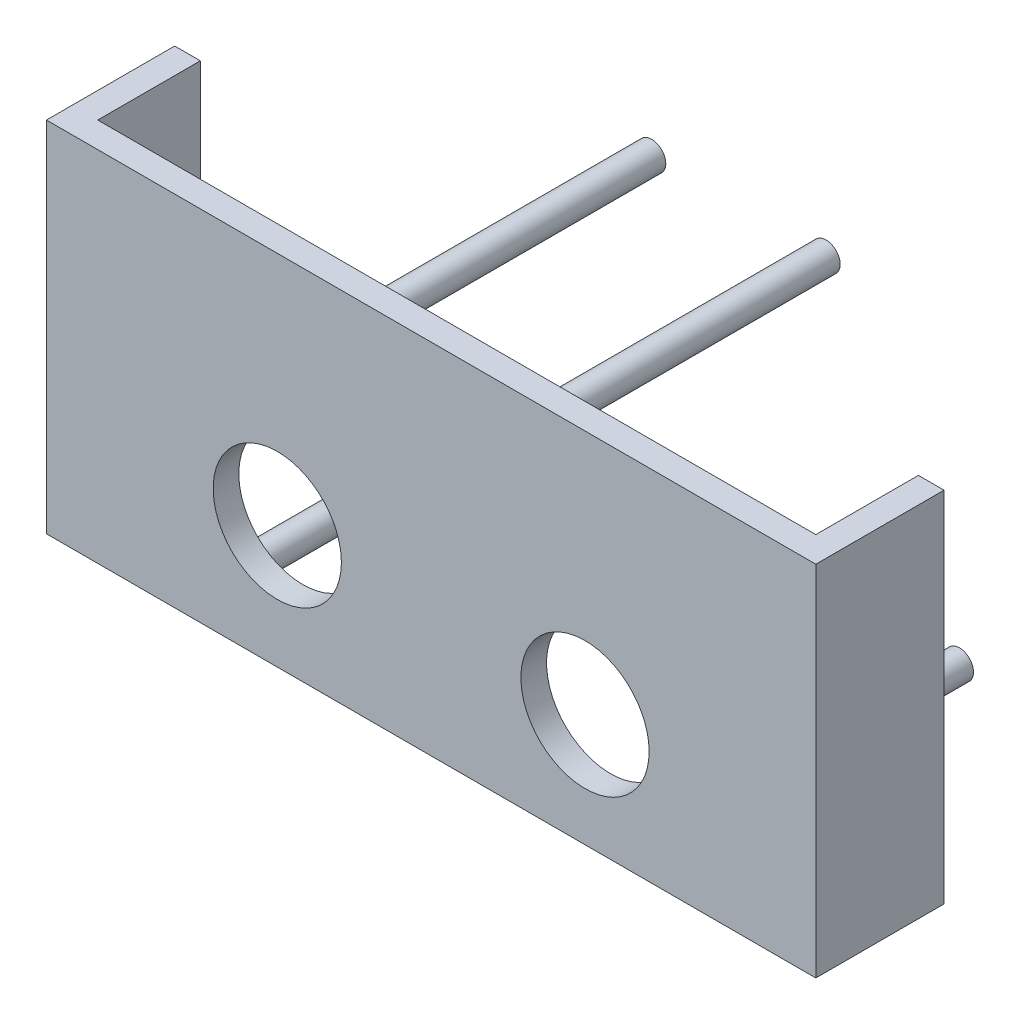
ISO-10303-21;
HEADER;
FILE_DESCRIPTION(('STEP AP214'),'2;1');
FILE_NAME('part.step','',(''),(''),'','','');
FILE_SCHEMA(('AUTOMOTIVE_DESIGN { 1 0 10303 214 1 1 1 1 }'));
ENDSEC;
DATA;
#1=APPLICATION_CONTEXT('core data for automotive mechanical design processes');
#2=APPLICATION_PROTOCOL_DEFINITION('international standard','automotive_design',2000,#1);
#3=PRODUCT_CONTEXT('',#1,'mechanical');
#4=PRODUCT('Part','Part','',(#3));
#5=PRODUCT_RELATED_PRODUCT_CATEGORY('part','',(#4));
#6=PRODUCT_DEFINITION_FORMATION('','',#4);
#7=PRODUCT_DEFINITION_CONTEXT('part definition',#1,'design');
#8=PRODUCT_DEFINITION('design','',#6,#7);
#9=PRODUCT_DEFINITION_SHAPE('','',#8);
#10=(LENGTH_UNIT() NAMED_UNIT(*) SI_UNIT(.MILLI.,.METRE.));
#11=(NAMED_UNIT(*) PLANE_ANGLE_UNIT() SI_UNIT($,.RADIAN.));
#12=(NAMED_UNIT(*) SI_UNIT($,.STERADIAN.) SOLID_ANGLE_UNIT());
#13=UNCERTAINTY_MEASURE_WITH_UNIT(LENGTH_MEASURE(1.E-05),#10,'distance_accuracy_value','');
#14=(GEOMETRIC_REPRESENTATION_CONTEXT(3) GLOBAL_UNCERTAINTY_ASSIGNED_CONTEXT((#13)) GLOBAL_UNIT_ASSIGNED_CONTEXT((#10,
#11,#12)) REPRESENTATION_CONTEXT('',''));
#15=CARTESIAN_POINT('',(0.,0.,0.));
#16=DIRECTION('',(0.,0.,1.));
#17=DIRECTION('',(1.,0.,0.));
#18=AXIS2_PLACEMENT_3D('',#15,#16,#17);
#19=CARTESIAN_POINT('',(0.,0.,0.));
#20=DIRECTION('',(0.,0.,1.));
#21=DIRECTION('',(1.,0.,0.));
#22=AXIS2_PLACEMENT_3D('',#19,#20,#21);
#23=PLANE('',#22);
#24=CARTESIAN_POINT('',(-7.,6.99999999999999,0.));
#25=DIRECTION('',(0.,0.,1.));
#26=DIRECTION('',(1.,0.,0.));
#27=AXIS2_PLACEMENT_3D('',#24,#25,#26);
#28=CIRCLE('',#27,2.75);
#29=CARTESIAN_POINT('',(-4.25,6.99999999999999,0.));
#30=VERTEX_POINT('',#29);
#31=EDGE_CURVE('E275',#30,#30,#28,.T.);
#32=ORIENTED_EDGE('',*,*,#31,.T.);
#33=EDGE_LOOP('',(#32));
#34=FACE_BOUND('',#33,.T.);
#35=CARTESIAN_POINT('',(-93.,6.99999999999999,0.));
#36=DIRECTION('',(0.,0.,1.));
#37=DIRECTION('',(1.,0.,0.));
#38=AXIS2_PLACEMENT_3D('',#35,#36,#37);
#39=CIRCLE('',#38,2.75000000000001);
#40=CARTESIAN_POINT('',(-90.25,6.99999999999999,0.));
#41=VERTEX_POINT('',#40);
#42=EDGE_CURVE('E282',#41,#41,#39,.T.);
#43=ORIENTED_EDGE('',*,*,#42,.T.);
#44=EDGE_LOOP('',(#43));
#45=FACE_BOUND('',#44,.T.);
#46=CARTESIAN_POINT('',(-33.,62.87,0.));
#47=DIRECTION('',(0.,0.,1.));
#48=DIRECTION('',(1.,0.,0.));
#49=AXIS2_PLACEMENT_3D('',#46,#47,#48);
#50=CIRCLE('',#49,2.75);
#51=CARTESIAN_POINT('',(-30.25,62.87,0.));
#52=VERTEX_POINT('',#51);
#53=EDGE_CURVE('E288',#52,#52,#50,.T.);
#54=ORIENTED_EDGE('',*,*,#53,.T.);
#55=EDGE_LOOP('',(#54));
#56=FACE_BOUND('',#55,.T.);
#57=CARTESIAN_POINT('',(-67.,62.87,0.));
#58=DIRECTION('',(0.,0.,1.));
#59=DIRECTION('',(1.,0.,0.));
#60=AXIS2_PLACEMENT_3D('',#57,#58,#59);
#61=CIRCLE('',#60,2.75000000000001);
#62=CARTESIAN_POINT('',(-64.25,62.87,0.));
#63=VERTEX_POINT('',#62);
#64=EDGE_CURVE('E125',#63,#63,#61,.T.);
#65=ORIENTED_EDGE('',*,*,#64,.T.);
#66=EDGE_LOOP('',(#65));
#67=FACE_BOUND('',#66,.T.);
#68=CARTESIAN_POINT('',(-20.,21.980812211656,0.));
#69=DIRECTION('',(0.,0.,1.));
#70=DIRECTION('',(1.,0.,0.));
#71=AXIS2_PLACEMENT_3D('',#68,#69,#70);
#72=CIRCLE('',#71,12.5);
#73=CARTESIAN_POINT('',(-7.5,21.980812211656,0.));
#74=VERTEX_POINT('',#73);
#75=EDGE_CURVE('E179',#74,#74,#72,.T.);
#76=ORIENTED_EDGE('',*,*,#75,.T.);
#77=EDGE_LOOP('',(#76));
#78=FACE_BOUND('',#77,.T.);
#79=CARTESIAN_POINT('',(-80.,23.9130923961962,0.));
#80=DIRECTION('',(0.,0.,1.));
#81=DIRECTION('',(1.,0.,0.));
#82=AXIS2_PLACEMENT_3D('',#79,#80,#81);
#83=CIRCLE('',#82,12.5);
#84=CARTESIAN_POINT('',(-67.5,23.9130923961962,0.));
#85=VERTEX_POINT('',#84);
#86=EDGE_CURVE('E185',#85,#85,#83,.T.);
#87=ORIENTED_EDGE('',*,*,#86,.T.);
#88=EDGE_LOOP('',(#87));
#89=FACE_BOUND('',#88,.T.);
#90=DIRECTION('',(0.,1.,0.));
#91=VECTOR('',#90,1.);
#92=CARTESIAN_POINT('',(20.,69.87,0.));
#93=LINE('',#92,#91);
#94=CARTESIAN_POINT('',(20.,0.,0.));
#95=VERTEX_POINT('',#94);
#96=CARTESIAN_POINT('',(20.,69.87,0.));
#97=VERTEX_POINT('',#96);
#98=EDGE_CURVE('E123',#95,#97,#93,.T.);
#99=ORIENTED_EDGE('',*,*,#98,.F.);
#100=DIRECTION('',(1.,0.,0.));
#101=VECTOR('',#100,1.);
#102=CARTESIAN_POINT('',(0.,0.,0.));
#103=LINE('',#102,#101);
#104=CARTESIAN_POINT('',(-120.,0.,0.));
#105=VERTEX_POINT('',#104);
#106=EDGE_CURVE('E154',#105,#95,#103,.T.);
#107=ORIENTED_EDGE('',*,*,#106,.F.);
#108=DIRECTION('',(0.,-1.,0.));
#109=VECTOR('',#108,1.);
#110=CARTESIAN_POINT('',(-120.,69.87,0.));
#111=LINE('',#110,#109);
#112=CARTESIAN_POINT('',(-120.,69.87,0.));
#113=VERTEX_POINT('',#112);
#114=EDGE_CURVE('E135',#113,#105,#111,.T.);
#115=ORIENTED_EDGE('',*,*,#114,.F.);
#116=DIRECTION('',(-1.,0.,0.));
#117=VECTOR('',#116,1.);
#118=CARTESIAN_POINT('',(0.,69.87,0.));
#119=LINE('',#118,#117);
#120=EDGE_CURVE('E37',#97,#113,#119,.T.);
#121=ORIENTED_EDGE('',*,*,#120,.F.);
#122=EDGE_LOOP('',(#99,#107,#115,#121));
#123=FACE_BOUND('',#122,.T.);
#124=ADVANCED_FACE('F33',(#34,#45,#56,#67,#78,#89,#123),#23,.F.);
#125=CARTESIAN_POINT('',(0.,69.87,5.));
#126=DIRECTION('',(0.,-1.,0.));
#127=DIRECTION('',(1.,0.,0.));
#128=AXIS2_PLACEMENT_3D('',#125,#126,#127);
#129=PLANE('',#128);
#130=DIRECTION('',(0.,0.,1.));
#131=VECTOR('',#130,1.);
#132=CARTESIAN_POINT('',(25.,69.87,0.));
#133=LINE('',#132,#131);
#134=CARTESIAN_POINT('',(25.,69.87,-20.));
#135=VERTEX_POINT('',#134);
#136=CARTESIAN_POINT('',(25.,69.87,5.));
#137=VERTEX_POINT('',#136);
#138=EDGE_CURVE('E108',#135,#137,#133,.T.);
#139=ORIENTED_EDGE('',*,*,#138,.F.);
#140=DIRECTION('',(1.,0.,0.));
#141=VECTOR('',#140,1.);
#142=CARTESIAN_POINT('',(25.,69.87,-20.));
#143=LINE('',#142,#141);
#144=CARTESIAN_POINT('',(20.,69.87,-20.));
#145=VERTEX_POINT('',#144);
#146=EDGE_CURVE('E122',#145,#135,#143,.T.);
#147=ORIENTED_EDGE('',*,*,#146,.F.);
#148=DIRECTION('',(0.,0.,1.));
#149=VECTOR('',#148,1.);
#150=CARTESIAN_POINT('',(20.,69.87,-20.));
#151=LINE('',#150,#149);
#152=EDGE_CURVE('E131',#145,#97,#151,.T.);
#153=ORIENTED_EDGE('',*,*,#152,.T.);
#154=ORIENTED_EDGE('',*,*,#120,.T.);
#155=DIRECTION('',(0.,0.,1.));
#156=VECTOR('',#155,1.);
#157=CARTESIAN_POINT('',(-120.,69.87,-20.));
#158=LINE('',#157,#156);
#159=CARTESIAN_POINT('',(-120.,69.87,-20.));
#160=VERTEX_POINT('',#159);
#161=EDGE_CURVE('E158',#160,#113,#158,.T.);
#162=ORIENTED_EDGE('',*,*,#161,.F.);
#163=DIRECTION('',(1.,0.,0.));
#164=VECTOR('',#163,1.);
#165=CARTESIAN_POINT('',(-125.,69.87,-20.));
#166=LINE('',#165,#164);
#167=CARTESIAN_POINT('',(-125.,69.87,-20.));
#168=VERTEX_POINT('',#167);
#169=EDGE_CURVE('E139',#168,#160,#166,.T.);
#170=ORIENTED_EDGE('',*,*,#169,.F.);
#171=DIRECTION('',(0.,0.,1.));
#172=VECTOR('',#171,1.);
#173=CARTESIAN_POINT('',(-125.,69.87,0.));
#174=LINE('',#173,#172);
#175=CARTESIAN_POINT('',(-125.,69.87,5.));
#176=VERTEX_POINT('',#175);
#177=EDGE_CURVE('E172',#168,#176,#174,.T.);
#178=ORIENTED_EDGE('',*,*,#177,.T.);
#179=DIRECTION('',(-1.,0.,0.));
#180=VECTOR('',#179,1.);
#181=CARTESIAN_POINT('',(0.,69.87,5.));
#182=LINE('',#181,#180);
#183=EDGE_CURVE('E43',#137,#176,#182,.T.);
#184=ORIENTED_EDGE('',*,*,#183,.F.);
#185=EDGE_LOOP('',(#139,#147,#153,#154,#162,#170,#178,#184));
#186=FACE_BOUND('',#185,.T.);
#187=ADVANCED_FACE('F35',(#186),#129,.F.);
#188=CARTESIAN_POINT('',(0.,0.,5.));
#189=DIRECTION('',(0.,1.,0.));
#190=DIRECTION('',(-1.,0.,0.));
#191=AXIS2_PLACEMENT_3D('',#188,#189,#190);
#192=PLANE('',#191);
#193=DIRECTION('',(0.,0.,1.));
#194=VECTOR('',#193,1.);
#195=CARTESIAN_POINT('',(-125.,0.,0.));
#196=LINE('',#195,#194);
#197=CARTESIAN_POINT('',(-125.,0.,-20.));
#198=VERTEX_POINT('',#197);
#199=CARTESIAN_POINT('',(-125.,0.,5.));
#200=VERTEX_POINT('',#199);
#201=EDGE_CURVE('E174',#198,#200,#196,.T.);
#202=ORIENTED_EDGE('',*,*,#201,.F.);
#203=DIRECTION('',(-1.,0.,0.));
#204=VECTOR('',#203,1.);
#205=CARTESIAN_POINT('',(-125.,0.,-20.));
#206=LINE('',#205,#204);
#207=CARTESIAN_POINT('',(-120.,0.,-20.));
#208=VERTEX_POINT('',#207);
#209=EDGE_CURVE('E143',#208,#198,#206,.T.);
#210=ORIENTED_EDGE('',*,*,#209,.F.);
#211=DIRECTION('',(0.,0.,1.));
#212=VECTOR('',#211,1.);
#213=CARTESIAN_POINT('',(-120.,0.,-20.));
#214=LINE('',#213,#212);
#215=EDGE_CURVE('E146',#208,#105,#214,.T.);
#216=ORIENTED_EDGE('',*,*,#215,.T.);
#217=ORIENTED_EDGE('',*,*,#106,.T.);
#218=DIRECTION('',(0.,0.,1.));
#219=VECTOR('',#218,1.);
#220=CARTESIAN_POINT('',(20.,0.,-20.));
#221=LINE('',#220,#219);
#222=CARTESIAN_POINT('',(20.,0.,-20.));
#223=VERTEX_POINT('',#222);
#224=EDGE_CURVE('E114',#223,#95,#221,.T.);
#225=ORIENTED_EDGE('',*,*,#224,.F.);
#226=DIRECTION('',(-1.,0.,0.));
#227=VECTOR('',#226,1.);
#228=CARTESIAN_POINT('',(25.,0.,-20.));
#229=LINE('',#228,#227);
#230=CARTESIAN_POINT('',(25.,0.,-20.));
#231=VERTEX_POINT('',#230);
#232=EDGE_CURVE('E111',#231,#223,#229,.T.);
#233=ORIENTED_EDGE('',*,*,#232,.F.);
#234=DIRECTION('',(0.,0.,1.));
#235=VECTOR('',#234,1.);
#236=CARTESIAN_POINT('',(25.,0.,0.));
#237=LINE('',#236,#235);
#238=CARTESIAN_POINT('',(25.,0.,5.));
#239=VERTEX_POINT('',#238);
#240=EDGE_CURVE('E100',#231,#239,#237,.T.);
#241=ORIENTED_EDGE('',*,*,#240,.T.);
#242=DIRECTION('',(1.,0.,0.));
#243=VECTOR('',#242,1.);
#244=CARTESIAN_POINT('',(0.,0.,5.));
#245=LINE('',#244,#243);
#246=EDGE_CURVE('E11',#200,#239,#245,.T.);
#247=ORIENTED_EDGE('',*,*,#246,.F.);
#248=EDGE_LOOP('',(#202,#210,#216,#217,#225,#233,#241,#247));
#249=FACE_BOUND('',#248,.T.);
#250=ADVANCED_FACE('F112',(#249),#192,.F.);
#251=CARTESIAN_POINT('',(0.,0.,5.));
#252=DIRECTION('',(0.,0.,1.));
#253=DIRECTION('',(1.,0.,0.));
#254=AXIS2_PLACEMENT_3D('',#251,#252,#253);
#255=PLANE('',#254);
#256=CARTESIAN_POINT('',(-20.,21.980812211656,5.));
#257=DIRECTION('',(0.,0.,1.));
#258=DIRECTION('',(1.,0.,0.));
#259=AXIS2_PLACEMENT_3D('',#256,#257,#258);
#260=CIRCLE('',#259,12.5);
#261=CARTESIAN_POINT('',(-7.5,21.980812211656,5.));
#262=VERTEX_POINT('',#261);
#263=EDGE_CURVE('E177',#262,#262,#260,.T.);
#264=ORIENTED_EDGE('',*,*,#263,.F.);
#265=EDGE_LOOP('',(#264));
#266=FACE_BOUND('',#265,.T.);
#267=CARTESIAN_POINT('',(-80.,23.9130923961962,5.));
#268=DIRECTION('',(0.,0.,1.));
#269=DIRECTION('',(1.,0.,0.));
#270=AXIS2_PLACEMENT_3D('',#267,#268,#269);
#271=CIRCLE('',#270,12.5);
#272=CARTESIAN_POINT('',(-67.5,23.9130923961962,5.));
#273=VERTEX_POINT('',#272);
#274=EDGE_CURVE('E182',#273,#273,#271,.T.);
#275=ORIENTED_EDGE('',*,*,#274,.F.);
#276=EDGE_LOOP('',(#275));
#277=FACE_BOUND('',#276,.T.);
#278=ORIENTED_EDGE('',*,*,#246,.T.);
#279=DIRECTION('',(0.,1.,0.));
#280=VECTOR('',#279,1.);
#281=CARTESIAN_POINT('',(25.,69.87,5.));
#282=LINE('',#281,#280);
#283=EDGE_CURVE('E107',#239,#137,#282,.T.);
#284=ORIENTED_EDGE('',*,*,#283,.T.);
#285=ORIENTED_EDGE('',*,*,#183,.T.);
#286=DIRECTION('',(0.,-1.,0.));
#287=VECTOR('',#286,1.);
#288=CARTESIAN_POINT('',(-125.,69.87,5.));
#289=LINE('',#288,#287);
#290=EDGE_CURVE('E170',#176,#200,#289,.T.);
#291=ORIENTED_EDGE('',*,*,#290,.T.);
#292=EDGE_LOOP('',(#278,#284,#285,#291));
#293=FACE_BOUND('',#292,.T.);
#294=ADVANCED_FACE('F166',(#266,#277,#293),#255,.T.);
#295=CARTESIAN_POINT('',(-80.,23.9130923961962,0.));
#296=DIRECTION('',(0.,0.,1.));
#297=DIRECTION('',(1.,0.,0.));
#298=AXIS2_PLACEMENT_3D('',#295,#296,#297);
#299=CYLINDRICAL_SURFACE('',#298,12.5);
#300=ORIENTED_EDGE('',*,*,#86,.F.);
#301=EDGE_LOOP('',(#300));
#302=FACE_BOUND('',#301,.T.);
#303=ORIENTED_EDGE('',*,*,#274,.T.);
#304=EDGE_LOOP('',(#303));
#305=FACE_BOUND('',#304,.T.);
#306=ADVANCED_FACE('F216',(#302,#305),#299,.F.);
#307=CARTESIAN_POINT('',(-20.,21.980812211656,0.));
#308=DIRECTION('',(0.,0.,1.));
#309=DIRECTION('',(1.,0.,0.));
#310=AXIS2_PLACEMENT_3D('',#307,#308,#309);
#311=CYLINDRICAL_SURFACE('',#310,12.5);
#312=ORIENTED_EDGE('',*,*,#75,.F.);
#313=EDGE_LOOP('',(#312));
#314=FACE_BOUND('',#313,.T.);
#315=ORIENTED_EDGE('',*,*,#263,.T.);
#316=EDGE_LOOP('',(#315));
#317=FACE_BOUND('',#316,.T.);
#318=ADVANCED_FACE('F220',(#314,#317),#311,.F.);
#319=CARTESIAN_POINT('',(-125.,69.87,0.));
#320=DIRECTION('',(-1.,0.,0.));
#321=DIRECTION('',(0.,0.,1.));
#322=AXIS2_PLACEMENT_3D('',#319,#320,#321);
#323=PLANE('',#322);
#324=ORIENTED_EDGE('',*,*,#290,.F.);
#325=ORIENTED_EDGE('',*,*,#177,.F.);
#326=DIRECTION('',(0.,1.,0.));
#327=VECTOR('',#326,1.);
#328=CARTESIAN_POINT('',(-125.,69.87,-20.));
#329=LINE('',#328,#327);
#330=EDGE_CURVE('E136',#198,#168,#329,.T.);
#331=ORIENTED_EDGE('',*,*,#330,.F.);
#332=ORIENTED_EDGE('',*,*,#201,.T.);
#333=EDGE_LOOP('',(#324,#325,#331,#332));
#334=FACE_BOUND('',#333,.T.);
#335=ADVANCED_FACE('F200',(#334),#323,.T.);
#336=CARTESIAN_POINT('',(25.,69.87,0.));
#337=DIRECTION('',(1.,0.,0.));
#338=DIRECTION('',(0.,1.,0.));
#339=AXIS2_PLACEMENT_3D('',#336,#337,#338);
#340=PLANE('',#339);
#341=ORIENTED_EDGE('',*,*,#283,.F.);
#342=ORIENTED_EDGE('',*,*,#240,.F.);
#343=DIRECTION('',(0.,-1.,0.));
#344=VECTOR('',#343,1.);
#345=CARTESIAN_POINT('',(25.,69.87,-20.));
#346=LINE('',#345,#344);
#347=EDGE_CURVE('E105',#135,#231,#346,.T.);
#348=ORIENTED_EDGE('',*,*,#347,.F.);
#349=ORIENTED_EDGE('',*,*,#138,.T.);
#350=EDGE_LOOP('',(#341,#342,#348,#349));
#351=FACE_BOUND('',#350,.T.);
#352=ADVANCED_FACE('F102',(#351),#340,.T.);
#353=CARTESIAN_POINT('',(-120.,69.87,-20.));
#354=DIRECTION('',(-1.,0.,0.));
#355=DIRECTION('',(0.,0.,1.));
#356=AXIS2_PLACEMENT_3D('',#353,#354,#355);
#357=PLANE('',#356);
#358=ORIENTED_EDGE('',*,*,#114,.T.);
#359=ORIENTED_EDGE('',*,*,#215,.F.);
#360=DIRECTION('',(0.,-1.,0.));
#361=VECTOR('',#360,1.);
#362=CARTESIAN_POINT('',(-120.,69.87,-20.));
#363=LINE('',#362,#361);
#364=EDGE_CURVE('E141',#160,#208,#363,.T.);
#365=ORIENTED_EDGE('',*,*,#364,.F.);
#366=ORIENTED_EDGE('',*,*,#161,.T.);
#367=EDGE_LOOP('',(#358,#359,#365,#366));
#368=FACE_BOUND('',#367,.T.);
#369=ADVANCED_FACE('F196',(#368),#357,.F.);
#370=CARTESIAN_POINT('',(0.,0.,-20.));
#371=DIRECTION('',(0.,0.,1.));
#372=DIRECTION('',(1.,0.,0.));
#373=AXIS2_PLACEMENT_3D('',#370,#371,#372);
#374=PLANE('',#373);
#375=ORIENTED_EDGE('',*,*,#330,.T.);
#376=ORIENTED_EDGE('',*,*,#169,.T.);
#377=ORIENTED_EDGE('',*,*,#364,.T.);
#378=ORIENTED_EDGE('',*,*,#209,.T.);
#379=EDGE_LOOP('',(#375,#376,#377,#378));
#380=FACE_BOUND('',#379,.T.);
#381=ADVANCED_FACE('F199',(#380),#374,.F.);
#382=CARTESIAN_POINT('',(20.,69.87,-20.));
#383=DIRECTION('',(1.,0.,0.));
#384=DIRECTION('',(0.,1.,0.));
#385=AXIS2_PLACEMENT_3D('',#382,#383,#384);
#386=PLANE('',#385);
#387=ORIENTED_EDGE('',*,*,#98,.T.);
#388=ORIENTED_EDGE('',*,*,#152,.F.);
#389=DIRECTION('',(0.,1.,0.));
#390=VECTOR('',#389,1.);
#391=CARTESIAN_POINT('',(20.,69.87,-20.));
#392=LINE('',#391,#390);
#393=EDGE_CURVE('E117',#223,#145,#392,.T.);
#394=ORIENTED_EDGE('',*,*,#393,.F.);
#395=ORIENTED_EDGE('',*,*,#224,.T.);
#396=EDGE_LOOP('',(#387,#388,#394,#395));
#397=FACE_BOUND('',#396,.T.);
#398=ADVANCED_FACE('F233',(#397),#386,.F.);
#399=CARTESIAN_POINT('',(0.,0.,-20.));
#400=DIRECTION('',(0.,0.,-1.));
#401=DIRECTION('',(-1.,0.,0.));
#402=AXIS2_PLACEMENT_3D('',#399,#400,#401);
#403=PLANE('',#402);
#404=ORIENTED_EDGE('',*,*,#347,.T.);
#405=ORIENTED_EDGE('',*,*,#232,.T.);
#406=ORIENTED_EDGE('',*,*,#393,.T.);
#407=ORIENTED_EDGE('',*,*,#146,.T.);
#408=EDGE_LOOP('',(#404,#405,#406,#407));
#409=FACE_BOUND('',#408,.T.);
#410=ADVANCED_FACE('F120',(#409),#403,.T.);
#411=CARTESIAN_POINT('',(-67.,62.87,-55.));
#412=DIRECTION('',(0.,0.,1.));
#413=DIRECTION('',(1.,0.,0.));
#414=AXIS2_PLACEMENT_3D('',#411,#412,#413);
#415=CYLINDRICAL_SURFACE('',#414,2.75000000000001);
#416=CARTESIAN_POINT('',(-67.,62.87,-55.));
#417=DIRECTION('',(0.,0.,1.));
#418=DIRECTION('',(1.,0.,0.));
#419=AXIS2_PLACEMENT_3D('',#416,#417,#418);
#420=CIRCLE('',#419,2.75000000000001);
#421=CARTESIAN_POINT('',(-64.25,62.87,-55.));
#422=VERTEX_POINT('',#421);
#423=EDGE_CURVE('E290',#422,#422,#420,.T.);
#424=ORIENTED_EDGE('',*,*,#423,.T.);
#425=EDGE_LOOP('',(#424));
#426=FACE_BOUND('',#425,.T.);
#427=ORIENTED_EDGE('',*,*,#64,.F.);
#428=EDGE_LOOP('',(#427));
#429=FACE_BOUND('',#428,.T.);
#430=ADVANCED_FACE('F239',(#426,#429),#415,.T.);
#431=CARTESIAN_POINT('',(-67.,62.87,-55.));
#432=DIRECTION('',(0.,0.,1.));
#433=DIRECTION('',(1.,0.,0.));
#434=AXIS2_PLACEMENT_3D('',#431,#432,#433);
#435=PLANE('',#434);
#436=ORIENTED_EDGE('',*,*,#423,.F.);
#437=EDGE_LOOP('',(#436));
#438=FACE_BOUND('',#437,.T.);
#439=ADVANCED_FACE('F242',(#438),#435,.F.);
#440=CARTESIAN_POINT('',(-33.,62.87,-55.));
#441=DIRECTION('',(0.,0.,1.));
#442=DIRECTION('',(1.,0.,0.));
#443=AXIS2_PLACEMENT_3D('',#440,#441,#442);
#444=CYLINDRICAL_SURFACE('',#443,2.75);
#445=CARTESIAN_POINT('',(-33.,62.87,-55.));
#446=DIRECTION('',(0.,0.,1.));
#447=DIRECTION('',(1.,0.,0.));
#448=AXIS2_PLACEMENT_3D('',#445,#446,#447);
#449=CIRCLE('',#448,2.75);
#450=CARTESIAN_POINT('',(-30.25,62.87,-55.));
#451=VERTEX_POINT('',#450);
#452=EDGE_CURVE('E285',#451,#451,#449,.T.);
#453=ORIENTED_EDGE('',*,*,#452,.T.);
#454=EDGE_LOOP('',(#453));
#455=FACE_BOUND('',#454,.T.);
#456=ORIENTED_EDGE('',*,*,#53,.F.);
#457=EDGE_LOOP('',(#456));
#458=FACE_BOUND('',#457,.T.);
#459=ADVANCED_FACE('F246',(#455,#458),#444,.T.);
#460=CARTESIAN_POINT('',(-33.,62.87,-55.));
#461=DIRECTION('',(0.,0.,1.));
#462=DIRECTION('',(1.,0.,0.));
#463=AXIS2_PLACEMENT_3D('',#460,#461,#462);
#464=PLANE('',#463);
#465=ORIENTED_EDGE('',*,*,#452,.F.);
#466=EDGE_LOOP('',(#465));
#467=FACE_BOUND('',#466,.T.);
#468=ADVANCED_FACE('F250',(#467),#464,.F.);
#469=CARTESIAN_POINT('',(-93.,6.99999999999999,-55.));
#470=DIRECTION('',(0.,0.,1.));
#471=DIRECTION('',(1.,0.,0.));
#472=AXIS2_PLACEMENT_3D('',#469,#470,#471);
#473=CYLINDRICAL_SURFACE('',#472,2.75000000000001);
#474=CARTESIAN_POINT('',(-93.,6.99999999999999,-55.));
#475=DIRECTION('',(0.,0.,1.));
#476=DIRECTION('',(1.,0.,0.));
#477=AXIS2_PLACEMENT_3D('',#474,#475,#476);
#478=CIRCLE('',#477,2.75000000000001);
#479=CARTESIAN_POINT('',(-90.25,6.99999999999999,-55.));
#480=VERTEX_POINT('',#479);
#481=EDGE_CURVE('E277',#480,#480,#478,.T.);
#482=ORIENTED_EDGE('',*,*,#481,.T.);
#483=EDGE_LOOP('',(#482));
#484=FACE_BOUND('',#483,.T.);
#485=ORIENTED_EDGE('',*,*,#42,.F.);
#486=EDGE_LOOP('',(#485));
#487=FACE_BOUND('',#486,.T.);
#488=ADVANCED_FACE('F254',(#484,#487),#473,.T.);
#489=CARTESIAN_POINT('',(-93.,6.99999999999999,-55.));
#490=DIRECTION('',(0.,0.,1.));
#491=DIRECTION('',(1.,0.,0.));
#492=AXIS2_PLACEMENT_3D('',#489,#490,#491);
#493=PLANE('',#492);
#494=ORIENTED_EDGE('',*,*,#481,.F.);
#495=EDGE_LOOP('',(#494));
#496=FACE_BOUND('',#495,.T.);
#497=ADVANCED_FACE('F258',(#496),#493,.F.);
#498=CARTESIAN_POINT('',(-7.,6.99999999999999,-55.));
#499=DIRECTION('',(0.,0.,1.));
#500=DIRECTION('',(1.,0.,0.));
#501=AXIS2_PLACEMENT_3D('',#498,#499,#500);
#502=CYLINDRICAL_SURFACE('',#501,2.75);
#503=CARTESIAN_POINT('',(-7.,6.99999999999999,-55.));
#504=DIRECTION('',(0.,0.,1.));
#505=DIRECTION('',(1.,0.,0.));
#506=AXIS2_PLACEMENT_3D('',#503,#504,#505);
#507=CIRCLE('',#506,2.75);
#508=CARTESIAN_POINT('',(-4.25,6.99999999999999,-55.));
#509=VERTEX_POINT('',#508);
#510=EDGE_CURVE('E274',#509,#509,#507,.T.);
#511=ORIENTED_EDGE('',*,*,#510,.T.);
#512=EDGE_LOOP('',(#511));
#513=FACE_BOUND('',#512,.T.);
#514=ORIENTED_EDGE('',*,*,#31,.F.);
#515=EDGE_LOOP('',(#514));
#516=FACE_BOUND('',#515,.T.);
#517=ADVANCED_FACE('F262',(#513,#516),#502,.T.);
#518=CARTESIAN_POINT('',(-7.,6.99999999999999,-55.));
#519=DIRECTION('',(0.,0.,1.));
#520=DIRECTION('',(1.,0.,0.));
#521=AXIS2_PLACEMENT_3D('',#518,#519,#520);
#522=PLANE('',#521);
#523=ORIENTED_EDGE('',*,*,#510,.F.);
#524=EDGE_LOOP('',(#523));
#525=FACE_BOUND('',#524,.T.);
#526=ADVANCED_FACE('F266',(#525),#522,.F.);
#527=CLOSED_SHELL('',(#124,#187,#250,#294,#306,#318,#335,#352,#369,#381,#398,#410,#430,#439,
#459,#468,#488,#497,#517,#526));
#528=MANIFOLD_SOLID_BREP('B2',#527);
#529=ADVANCED_BREP_SHAPE_REPRESENTATION('',(#18,#528),#14);
#530=SHAPE_DEFINITION_REPRESENTATION(#9,#529);
ENDSEC;
END-ISO-10303-21;
